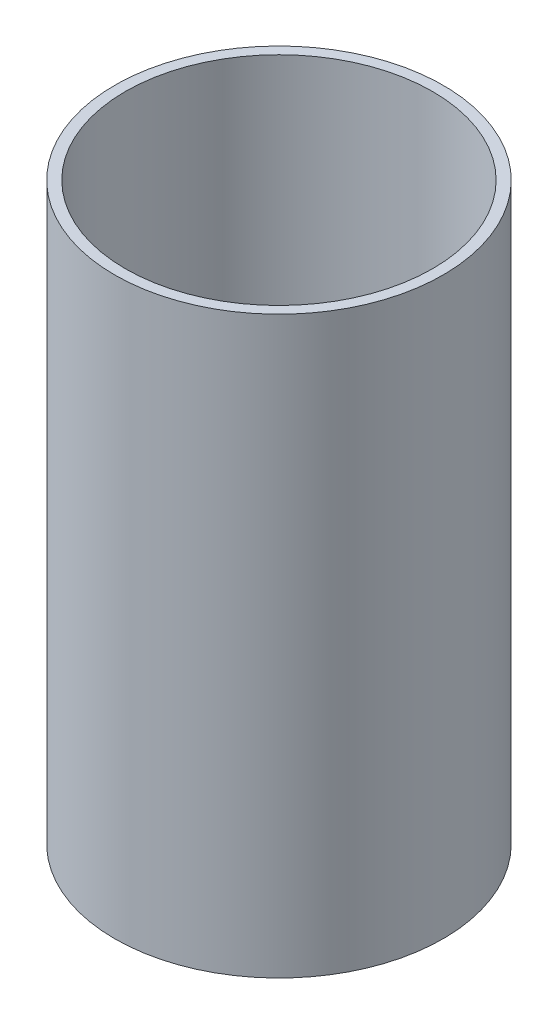
ISO-10303-21;
HEADER;
FILE_DESCRIPTION(('STEP AP214'),'2;1');
FILE_NAME('part.step','',(''),(''),'','','');
FILE_SCHEMA(('AUTOMOTIVE_DESIGN { 1 0 10303 214 1 1 1 1 }'));
ENDSEC;
DATA;
#1=APPLICATION_CONTEXT('core data for automotive mechanical design processes');
#2=APPLICATION_PROTOCOL_DEFINITION('international standard','automotive_design',2000,#1);
#3=PRODUCT_CONTEXT('',#1,'mechanical');
#4=PRODUCT('Part','Part','',(#3));
#5=PRODUCT_RELATED_PRODUCT_CATEGORY('part','',(#4));
#6=PRODUCT_DEFINITION_FORMATION('','',#4);
#7=PRODUCT_DEFINITION_CONTEXT('part definition',#1,'design');
#8=PRODUCT_DEFINITION('design','',#6,#7);
#9=PRODUCT_DEFINITION_SHAPE('','',#8);
#10=(LENGTH_UNIT() NAMED_UNIT(*) SI_UNIT(.MILLI.,.METRE.));
#11=(NAMED_UNIT(*) PLANE_ANGLE_UNIT() SI_UNIT($,.RADIAN.));
#12=(NAMED_UNIT(*) SI_UNIT($,.STERADIAN.) SOLID_ANGLE_UNIT());
#13=UNCERTAINTY_MEASURE_WITH_UNIT(LENGTH_MEASURE(1.E-05),#10,'distance_accuracy_value','');
#14=(GEOMETRIC_REPRESENTATION_CONTEXT(3) GLOBAL_UNCERTAINTY_ASSIGNED_CONTEXT((#13)) GLOBAL_UNIT_ASSIGNED_CONTEXT((#10,
#11,#12)) REPRESENTATION_CONTEXT('',''));
#15=CARTESIAN_POINT('',(0.,0.,0.));
#16=DIRECTION('',(0.,0.,1.));
#17=DIRECTION('',(1.,0.,0.));
#18=AXIS2_PLACEMENT_3D('',#15,#16,#17);
#19=CARTESIAN_POINT('',(0.,88.9,0.));
#20=DIRECTION('',(0.,1.,0.));
#21=DIRECTION('',(0.,0.,1.));
#22=AXIS2_PLACEMENT_3D('',#19,#20,#21);
#23=PLANE('',#22);
#24=CARTESIAN_POINT('',(0.,88.9,0.));
#25=DIRECTION('',(0.,1.,0.));
#26=DIRECTION('',(0.,0.,1.));
#27=AXIS2_PLACEMENT_3D('',#24,#25,#26);
#28=CIRCLE('',#27,25.4);
#29=CARTESIAN_POINT('',(0.,88.9,25.4));
#30=VERTEX_POINT('',#29);
#31=EDGE_CURVE('E10',#30,#30,#28,.T.);
#32=ORIENTED_EDGE('',*,*,#31,.T.);
#33=EDGE_LOOP('',(#32));
#34=FACE_BOUND('',#33,.T.);
#35=CARTESIAN_POINT('',(0.,88.9,0.));
#36=DIRECTION('',(0.,1.,0.));
#37=DIRECTION('',(0.,0.,1.));
#38=AXIS2_PLACEMENT_3D('',#35,#36,#37);
#39=CIRCLE('',#38,23.749);
#40=CARTESIAN_POINT('',(0.,88.9,23.749));
#41=VERTEX_POINT('',#40);
#42=EDGE_CURVE('E50',#41,#41,#39,.T.);
#43=ORIENTED_EDGE('',*,*,#42,.F.);
#44=EDGE_LOOP('',(#43));
#45=FACE_BOUND('',#44,.T.);
#46=ADVANCED_FACE('F39',(#34,#45),#23,.T.);
#47=CARTESIAN_POINT('',(0.,0.,0.));
#48=DIRECTION('',(0.,1.,0.));
#49=DIRECTION('',(0.,0.,1.));
#50=AXIS2_PLACEMENT_3D('',#47,#48,#49);
#51=PLANE('',#50);
#52=CARTESIAN_POINT('',(0.,0.,0.));
#53=DIRECTION('',(0.,1.,0.));
#54=DIRECTION('',(0.,0.,1.));
#55=AXIS2_PLACEMENT_3D('',#52,#53,#54);
#56=CIRCLE('',#55,25.4);
#57=CARTESIAN_POINT('',(0.,0.,25.4));
#58=VERTEX_POINT('',#57);
#59=EDGE_CURVE('E43',#58,#58,#56,.T.);
#60=ORIENTED_EDGE('',*,*,#59,.F.);
#61=EDGE_LOOP('',(#60));
#62=FACE_BOUND('',#61,.T.);
#63=CARTESIAN_POINT('',(0.,0.,0.));
#64=DIRECTION('',(0.,1.,0.));
#65=DIRECTION('',(0.,0.,1.));
#66=AXIS2_PLACEMENT_3D('',#63,#64,#65);
#67=CIRCLE('',#66,23.749);
#68=CARTESIAN_POINT('',(0.,0.,23.749));
#69=VERTEX_POINT('',#68);
#70=EDGE_CURVE('E52',#69,#69,#67,.T.);
#71=ORIENTED_EDGE('',*,*,#70,.T.);
#72=EDGE_LOOP('',(#71));
#73=FACE_BOUND('',#72,.T.);
#74=ADVANCED_FACE('F62',(#62,#73),#51,.F.);
#75=CARTESIAN_POINT('',(0.,88.9,0.));
#76=DIRECTION('',(0.,-1.,0.));
#77=DIRECTION('',(0.,0.,-1.));
#78=AXIS2_PLACEMENT_3D('',#75,#76,#77);
#79=CYLINDRICAL_SURFACE('',#78,25.4);
#80=ORIENTED_EDGE('',*,*,#31,.F.);
#81=EDGE_LOOP('',(#80));
#82=FACE_BOUND('',#81,.T.);
#83=ORIENTED_EDGE('',*,*,#59,.T.);
#84=EDGE_LOOP('',(#83));
#85=FACE_BOUND('',#84,.T.);
#86=ADVANCED_FACE('F41',(#82,#85),#79,.T.);
#87=CARTESIAN_POINT('',(0.,88.9,0.));
#88=DIRECTION('',(0.,-1.,0.));
#89=DIRECTION('',(0.,0.,-1.));
#90=AXIS2_PLACEMENT_3D('',#87,#88,#89);
#91=CYLINDRICAL_SURFACE('',#90,23.749);
#92=ORIENTED_EDGE('',*,*,#42,.T.);
#93=EDGE_LOOP('',(#92));
#94=FACE_BOUND('',#93,.T.);
#95=ORIENTED_EDGE('',*,*,#70,.F.);
#96=EDGE_LOOP('',(#95));
#97=FACE_BOUND('',#96,.T.);
#98=ADVANCED_FACE('F58',(#94,#97),#91,.F.);
#99=CLOSED_SHELL('',(#46,#74,#86,#98));
#100=MANIFOLD_SOLID_BREP('B2',#99);
#101=ADVANCED_BREP_SHAPE_REPRESENTATION('',(#18,#100),#14);
#102=SHAPE_DEFINITION_REPRESENTATION(#9,#101);
ENDSEC;
END-ISO-10303-21;
